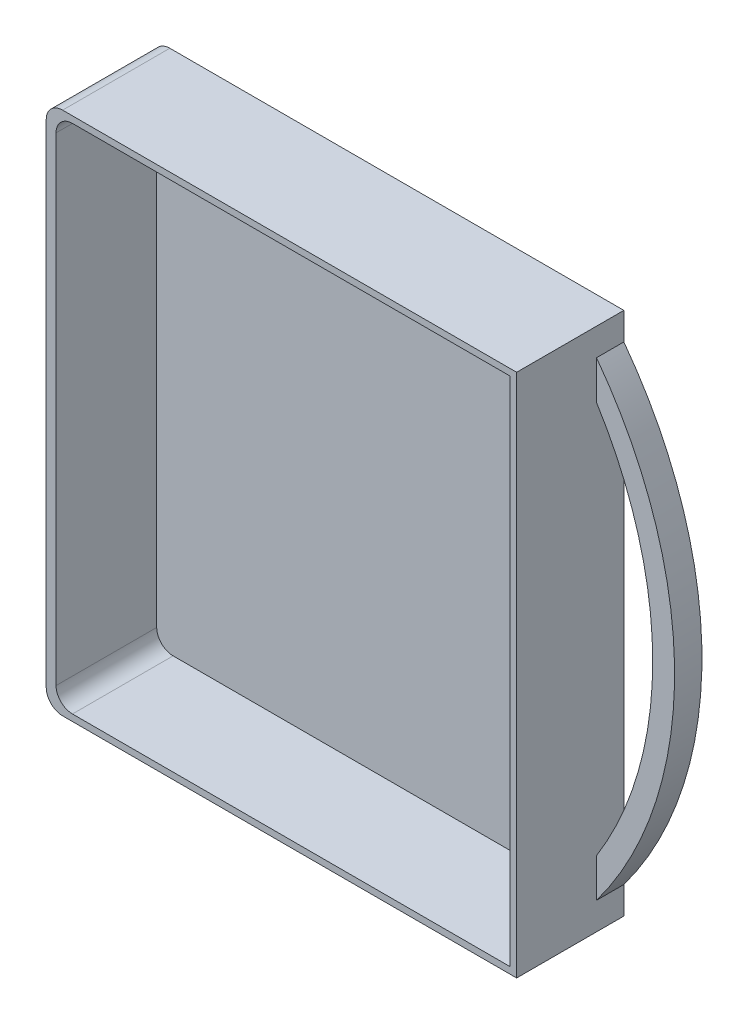
ISO-10303-21;
HEADER;
FILE_DESCRIPTION(('STEP AP214'),'2;1');
FILE_NAME('part.step','',(''),(''),'','','');
FILE_SCHEMA(('AUTOMOTIVE_DESIGN { 1 0 10303 214 1 1 1 1 }'));
ENDSEC;
DATA;
#1=APPLICATION_CONTEXT('core data for automotive mechanical design processes');
#2=APPLICATION_PROTOCOL_DEFINITION('international standard','automotive_design',2000,#1);
#3=PRODUCT_CONTEXT('',#1,'mechanical');
#4=PRODUCT('Part','Part','',(#3));
#5=PRODUCT_RELATED_PRODUCT_CATEGORY('part','',(#4));
#6=PRODUCT_DEFINITION_FORMATION('','',#4);
#7=PRODUCT_DEFINITION_CONTEXT('part definition',#1,'design');
#8=PRODUCT_DEFINITION('design','',#6,#7);
#9=PRODUCT_DEFINITION_SHAPE('','',#8);
#10=(LENGTH_UNIT() NAMED_UNIT(*) SI_UNIT(.MILLI.,.METRE.));
#11=(NAMED_UNIT(*) PLANE_ANGLE_UNIT() SI_UNIT($,.RADIAN.));
#12=(NAMED_UNIT(*) SI_UNIT($,.STERADIAN.) SOLID_ANGLE_UNIT());
#13=UNCERTAINTY_MEASURE_WITH_UNIT(LENGTH_MEASURE(1.E-05),#10,'distance_accuracy_value','');
#14=(GEOMETRIC_REPRESENTATION_CONTEXT(3) GLOBAL_UNCERTAINTY_ASSIGNED_CONTEXT((#13)) GLOBAL_UNIT_ASSIGNED_CONTEXT((#10,
#11,#12)) REPRESENTATION_CONTEXT('',''));
#15=CARTESIAN_POINT('',(0.,0.,0.));
#16=DIRECTION('',(0.,0.,1.));
#17=DIRECTION('',(1.,0.,0.));
#18=AXIS2_PLACEMENT_3D('',#15,#16,#17);
#19=CARTESIAN_POINT('',(43.,47.95,19.6));
#20=DIRECTION('',(-1.,0.,0.));
#21=DIRECTION('',(0.,-1.,0.));
#22=AXIS2_PLACEMENT_3D('',#19,#20,#21);
#23=PLANE('',#22);
#24=DIRECTION('',(0.,1.,0.));
#25=VECTOR('',#24,1.);
#26=CARTESIAN_POINT('',(43.,-42.95,5.));
#27=LINE('',#26,#25);
#28=CARTESIAN_POINT('',(43.,-42.95,5.));
#29=VERTEX_POINT('',#28);
#30=CARTESIAN_POINT('',(43.,-35.8706356230276,5.));
#31=VERTEX_POINT('',#30);
#32=EDGE_CURVE('E205',#29,#31,#27,.T.);
#33=ORIENTED_EDGE('',*,*,#32,.T.);
#34=DIRECTION('',(0.,0.,-1.));
#35=VECTOR('',#34,1.);
#36=CARTESIAN_POINT('',(43.,-35.8706356230276,5.));
#37=LINE('',#36,#35);
#38=CARTESIAN_POINT('',(43.,-35.8706356230276,0.));
#39=VERTEX_POINT('',#38);
#40=EDGE_CURVE('E212',#31,#39,#37,.T.);
#41=ORIENTED_EDGE('',*,*,#40,.T.);
#42=DIRECTION('',(0.,1.,0.));
#43=VECTOR('',#42,1.);
#44=CARTESIAN_POINT('',(43.,47.95,0.));
#45=LINE('',#44,#43);
#46=CARTESIAN_POINT('',(43.,35.8706356230276,0.));
#47=VERTEX_POINT('',#46);
#48=EDGE_CURVE('E238',#39,#47,#45,.T.);
#49=ORIENTED_EDGE('',*,*,#48,.T.);
#50=DIRECTION('',(0.,0.,-1.));
#51=VECTOR('',#50,1.);
#52=CARTESIAN_POINT('',(43.,35.8706356230276,5.));
#53=LINE('',#52,#51);
#54=CARTESIAN_POINT('',(43.,35.8706356230276,5.));
#55=VERTEX_POINT('',#54);
#56=EDGE_CURVE('E207',#55,#47,#53,.T.);
#57=ORIENTED_EDGE('',*,*,#56,.F.);
#58=DIRECTION('',(0.,1.,0.));
#59=VECTOR('',#58,1.);
#60=CARTESIAN_POINT('',(43.,35.8706356230276,5.));
#61=LINE('',#60,#59);
#62=CARTESIAN_POINT('',(43.,42.95,5.));
#63=VERTEX_POINT('',#62);
#64=EDGE_CURVE('E199',#55,#63,#61,.T.);
#65=ORIENTED_EDGE('',*,*,#64,.T.);
#66=DIRECTION('',(0.,0.,-1.));
#67=VECTOR('',#66,1.);
#68=CARTESIAN_POINT('',(43.,42.95,5.));
#69=LINE('',#68,#67);
#70=CARTESIAN_POINT('',(43.,42.95,0.));
#71=VERTEX_POINT('',#70);
#72=EDGE_CURVE('E219',#63,#71,#69,.T.);
#73=ORIENTED_EDGE('',*,*,#72,.T.);
#74=CARTESIAN_POINT('',(43.,47.95,0.));
#75=VERTEX_POINT('',#74);
#76=EDGE_CURVE('E215',#71,#75,#45,.T.);
#77=ORIENTED_EDGE('',*,*,#76,.T.);
#78=DIRECTION('',(0.,0.,-1.));
#79=VECTOR('',#78,1.);
#80=CARTESIAN_POINT('',(43.,47.95,19.6));
#81=LINE('',#80,#79);
#82=CARTESIAN_POINT('',(43.,47.95,19.6));
#83=VERTEX_POINT('',#82);
#84=EDGE_CURVE('E245',#83,#75,#81,.T.);
#85=ORIENTED_EDGE('',*,*,#84,.F.);
#86=DIRECTION('',(0.,1.,0.));
#87=VECTOR('',#86,1.);
#88=CARTESIAN_POINT('',(43.,47.95,19.6));
#89=LINE('',#88,#87);
#90=CARTESIAN_POINT('',(43.,-47.95,19.6));
#91=VERTEX_POINT('',#90);
#92=EDGE_CURVE('E224',#91,#83,#89,.T.);
#93=ORIENTED_EDGE('',*,*,#92,.F.);
#94=DIRECTION('',(0.,0.,-1.));
#95=VECTOR('',#94,1.);
#96=CARTESIAN_POINT('',(43.,-47.95,19.6));
#97=LINE('',#96,#95);
#98=CARTESIAN_POINT('',(43.,-47.95,0.));
#99=VERTEX_POINT('',#98);
#100=EDGE_CURVE('E234',#91,#99,#97,.T.);
#101=ORIENTED_EDGE('',*,*,#100,.T.);
#102=CARTESIAN_POINT('',(43.,-42.95,0.));
#103=VERTEX_POINT('',#102);
#104=EDGE_CURVE('E235',#99,#103,#45,.T.);
#105=ORIENTED_EDGE('',*,*,#104,.T.);
#106=DIRECTION('',(0.,0.,-1.));
#107=VECTOR('',#106,1.);
#108=CARTESIAN_POINT('',(43.,-42.95,5.));
#109=LINE('',#108,#107);
#110=EDGE_CURVE('E216',#29,#103,#109,.T.);
#111=ORIENTED_EDGE('',*,*,#110,.F.);
#112=EDGE_LOOP('',(#33,#41,#49,#57,#65,#73,#77,#85,#93,#101,#105,#111));
#113=FACE_BOUND('',#112,.T.);
#114=ADVANCED_FACE('F39',(#113),#23,.F.);
#115=CARTESIAN_POINT('',(-43.,47.95,19.6));
#116=DIRECTION('',(0.,-1.,0.));
#117=DIRECTION('',(0.,0.,-1.));
#118=AXIS2_PLACEMENT_3D('',#115,#116,#117);
#119=PLANE('',#118);
#120=DIRECTION('',(-1.,0.,0.));
#121=VECTOR('',#120,1.);
#122=CARTESIAN_POINT('',(-43.,47.95,0.));
#123=LINE('',#122,#121);
#124=CARTESIAN_POINT('',(-40.,47.95,0.));
#125=VERTEX_POINT('',#124);
#126=EDGE_CURVE('E237',#75,#125,#123,.T.);
#127=ORIENTED_EDGE('',*,*,#126,.T.);
#128=DIRECTION('',(0.,0.,-1.));
#129=VECTOR('',#128,1.);
#130=CARTESIAN_POINT('',(-40.,47.95,19.6));
#131=LINE('',#130,#129);
#132=CARTESIAN_POINT('',(-40.,47.95,19.6));
#133=VERTEX_POINT('',#132);
#134=EDGE_CURVE('E54',#125,#133,#131,.F.);
#135=ORIENTED_EDGE('',*,*,#134,.T.);
#136=DIRECTION('',(-1.,0.,0.));
#137=VECTOR('',#136,1.);
#138=CARTESIAN_POINT('',(-43.,47.95,19.6));
#139=LINE('',#138,#137);
#140=EDGE_CURVE('E227',#83,#133,#139,.T.);
#141=ORIENTED_EDGE('',*,*,#140,.F.);
#142=ORIENTED_EDGE('',*,*,#84,.T.);
#143=EDGE_LOOP('',(#127,#135,#141,#142));
#144=FACE_BOUND('',#143,.T.);
#145=ADVANCED_FACE('F303',(#144),#119,.F.);
#146=CARTESIAN_POINT('',(-43.,47.95,19.6));
#147=DIRECTION('',(1.,0.,0.));
#148=DIRECTION('',(0.,1.,0.));
#149=AXIS2_PLACEMENT_3D('',#146,#147,#148);
#150=PLANE('',#149);
#151=DIRECTION('',(0.,-1.,0.));
#152=VECTOR('',#151,1.);
#153=CARTESIAN_POINT('',(-43.,47.95,0.));
#154=LINE('',#153,#152);
#155=CARTESIAN_POINT('',(-43.,44.95,0.));
#156=VERTEX_POINT('',#155);
#157=CARTESIAN_POINT('',(-43.,-44.95,0.));
#158=VERTEX_POINT('',#157);
#159=EDGE_CURVE('E240',#156,#158,#154,.T.);
#160=ORIENTED_EDGE('',*,*,#159,.T.);
#161=DIRECTION('',(0.,0.,-1.));
#162=VECTOR('',#161,1.);
#163=CARTESIAN_POINT('',(-43.,-44.95,19.6));
#164=LINE('',#163,#162);
#165=CARTESIAN_POINT('',(-43.,-44.95,19.6));
#166=VERTEX_POINT('',#165);
#167=EDGE_CURVE('E62',#158,#166,#164,.F.);
#168=ORIENTED_EDGE('',*,*,#167,.T.);
#169=DIRECTION('',(0.,-1.,0.));
#170=VECTOR('',#169,1.);
#171=CARTESIAN_POINT('',(-43.,47.95,19.6));
#172=LINE('',#171,#170);
#173=CARTESIAN_POINT('',(-43.,44.95,19.6));
#174=VERTEX_POINT('',#173);
#175=EDGE_CURVE('E230',#174,#166,#172,.T.);
#176=ORIENTED_EDGE('',*,*,#175,.F.);
#177=DIRECTION('',(0.,0.,-1.));
#178=VECTOR('',#177,1.);
#179=CARTESIAN_POINT('',(-43.,44.95,19.6));
#180=LINE('',#179,#178);
#181=EDGE_CURVE('E267',#174,#156,#180,.T.);
#182=ORIENTED_EDGE('',*,*,#181,.T.);
#183=EDGE_LOOP('',(#160,#168,#176,#182));
#184=FACE_BOUND('',#183,.T.);
#185=ADVANCED_FACE('F309',(#184),#150,.F.);
#186=CARTESIAN_POINT('',(-43.,-47.95,19.6));
#187=DIRECTION('',(0.,1.,0.));
#188=DIRECTION('',(0.,0.,1.));
#189=AXIS2_PLACEMENT_3D('',#186,#187,#188);
#190=PLANE('',#189);
#191=DIRECTION('',(1.,0.,0.));
#192=VECTOR('',#191,1.);
#193=CARTESIAN_POINT('',(-43.,-47.95,19.6));
#194=LINE('',#193,#192);
#195=CARTESIAN_POINT('',(-40.,-47.95,19.6));
#196=VERTEX_POINT('',#195);
#197=EDGE_CURVE('E232',#196,#91,#194,.T.);
#198=ORIENTED_EDGE('',*,*,#197,.F.);
#199=DIRECTION('',(0.,0.,-1.));
#200=VECTOR('',#199,1.);
#201=CARTESIAN_POINT('',(-40.,-47.95,19.6));
#202=LINE('',#201,#200);
#203=CARTESIAN_POINT('',(-40.,-47.95,0.));
#204=VERTEX_POINT('',#203);
#205=EDGE_CURVE('E260',#196,#204,#202,.T.);
#206=ORIENTED_EDGE('',*,*,#205,.T.);
#207=DIRECTION('',(1.,0.,0.));
#208=VECTOR('',#207,1.);
#209=CARTESIAN_POINT('',(-43.,-47.95,0.));
#210=LINE('',#209,#208);
#211=EDGE_CURVE('E228',#204,#99,#210,.T.);
#212=ORIENTED_EDGE('',*,*,#211,.T.);
#213=ORIENTED_EDGE('',*,*,#100,.F.);
#214=EDGE_LOOP('',(#198,#206,#212,#213));
#215=FACE_BOUND('',#214,.T.);
#216=ADVANCED_FACE('F314',(#215),#190,.F.);
#217=CARTESIAN_POINT('',(0.,0.,19.6));
#218=DIRECTION('',(0.,0.,1.));
#219=DIRECTION('',(1.,0.,0.));
#220=AXIS2_PLACEMENT_3D('',#217,#218,#219);
#221=PLANE('',#220);
#222=DIRECTION('',(0.,-1.,0.));
#223=VECTOR('',#222,1.);
#224=CARTESIAN_POINT('',(-41.2,46.75,19.6));
#225=LINE('',#224,#223);
#226=CARTESIAN_POINT('',(-41.2,43.75,19.6));
#227=VERTEX_POINT('',#226);
#228=CARTESIAN_POINT('',(-41.2,-43.75,19.6));
#229=VERTEX_POINT('',#228);
#230=EDGE_CURVE('E185',#227,#229,#225,.T.);
#231=ORIENTED_EDGE('',*,*,#230,.F.);
#232=CARTESIAN_POINT('',(-38.2,43.75,19.6));
#233=DIRECTION('',(0.,0.,1.));
#234=DIRECTION('',(1.,0.,0.));
#235=AXIS2_PLACEMENT_3D('',#232,#233,#234);
#236=CIRCLE('',#235,3.);
#237=CARTESIAN_POINT('',(-38.2,46.75,19.6));
#238=VERTEX_POINT('',#237);
#239=EDGE_CURVE('E47',#227,#238,#236,.F.);
#240=ORIENTED_EDGE('',*,*,#239,.T.);
#241=DIRECTION('',(-1.,0.,0.));
#242=VECTOR('',#241,1.);
#243=CARTESIAN_POINT('',(41.8,46.75,19.6));
#244=LINE('',#243,#242);
#245=CARTESIAN_POINT('',(41.8,46.75,19.6));
#246=VERTEX_POINT('',#245);
#247=EDGE_CURVE('E191',#246,#238,#244,.T.);
#248=ORIENTED_EDGE('',*,*,#247,.F.);
#249=DIRECTION('',(0.,1.,0.));
#250=VECTOR('',#249,1.);
#251=CARTESIAN_POINT('',(41.8,-46.75,19.6));
#252=LINE('',#251,#250);
#253=CARTESIAN_POINT('',(41.8,-46.75,19.6));
#254=VERTEX_POINT('',#253);
#255=EDGE_CURVE('E189',#254,#246,#252,.T.);
#256=ORIENTED_EDGE('',*,*,#255,.F.);
#257=DIRECTION('',(1.,0.,0.));
#258=VECTOR('',#257,1.);
#259=CARTESIAN_POINT('',(-41.2,-46.75,19.6));
#260=LINE('',#259,#258);
#261=CARTESIAN_POINT('',(-38.2,-46.75,19.6));
#262=VERTEX_POINT('',#261);
#263=EDGE_CURVE('E173',#262,#254,#260,.T.);
#264=ORIENTED_EDGE('',*,*,#263,.F.);
#265=CARTESIAN_POINT('',(-38.2,-43.75,19.6));
#266=DIRECTION('',(0.,0.,1.));
#267=DIRECTION('',(1.,0.,0.));
#268=AXIS2_PLACEMENT_3D('',#265,#266,#267);
#269=CIRCLE('',#268,3.);
#270=EDGE_CURVE('E11',#262,#229,#269,.F.);
#271=ORIENTED_EDGE('',*,*,#270,.T.);
#272=EDGE_LOOP('',(#231,#240,#248,#256,#264,#271));
#273=FACE_BOUND('',#272,.T.);
#274=ORIENTED_EDGE('',*,*,#175,.T.);
#275=CARTESIAN_POINT('',(-40.,-44.95,19.6));
#276=DIRECTION('',(0.,0.,1.));
#277=DIRECTION('',(1.,0.,0.));
#278=AXIS2_PLACEMENT_3D('',#275,#276,#277);
#279=CIRCLE('',#278,3.);
#280=EDGE_CURVE('E273',#166,#196,#279,.T.);
#281=ORIENTED_EDGE('',*,*,#280,.T.);
#282=ORIENTED_EDGE('',*,*,#197,.T.);
#283=ORIENTED_EDGE('',*,*,#92,.T.);
#284=ORIENTED_EDGE('',*,*,#140,.T.);
#285=CARTESIAN_POINT('',(-40.,44.95,19.6));
#286=DIRECTION('',(0.,0.,1.));
#287=DIRECTION('',(1.,0.,0.));
#288=AXIS2_PLACEMENT_3D('',#285,#286,#287);
#289=CIRCLE('',#288,3.);
#290=EDGE_CURVE('E271',#133,#174,#289,.T.);
#291=ORIENTED_EDGE('',*,*,#290,.T.);
#292=EDGE_LOOP('',(#274,#281,#282,#283,#284,#291));
#293=FACE_BOUND('',#292,.T.);
#294=ADVANCED_FACE('F278',(#273,#293),#221,.T.);
#295=CARTESIAN_POINT('',(0.,0.,0.));
#296=DIRECTION('',(0.,0.,1.));
#297=DIRECTION('',(1.,0.,0.));
#298=AXIS2_PLACEMENT_3D('',#295,#296,#297);
#299=PLANE('',#298);
#300=ORIENTED_EDGE('',*,*,#48,.F.);
#301=CARTESIAN_POINT('',(-14.4748640711745,0.,0.));
#302=DIRECTION('',(0.,0.,1.));
#303=DIRECTION('',(1.,0.,0.));
#304=AXIS2_PLACEMENT_3D('',#301,#302,#303);
#305=CIRCLE('',#304,67.75);
#306=EDGE_CURVE('E194',#39,#47,#305,.T.);
#307=ORIENTED_EDGE('',*,*,#306,.T.);
#308=EDGE_LOOP('',(#300,#307));
#309=FACE_BOUND('',#308,.T.);
#310=ORIENTED_EDGE('',*,*,#211,.F.);
#311=CARTESIAN_POINT('',(-40.,-44.95,0.));
#312=DIRECTION('',(0.,0.,1.));
#313=DIRECTION('',(1.,0.,0.));
#314=AXIS2_PLACEMENT_3D('',#311,#312,#313);
#315=CIRCLE('',#314,3.);
#316=EDGE_CURVE('E265',#204,#158,#315,.F.);
#317=ORIENTED_EDGE('',*,*,#316,.T.);
#318=ORIENTED_EDGE('',*,*,#159,.F.);
#319=CARTESIAN_POINT('',(-40.,44.95,0.));
#320=DIRECTION('',(0.,0.,1.));
#321=DIRECTION('',(1.,0.,0.));
#322=AXIS2_PLACEMENT_3D('',#319,#320,#321);
#323=CIRCLE('',#322,3.);
#324=EDGE_CURVE('E263',#156,#125,#323,.F.);
#325=ORIENTED_EDGE('',*,*,#324,.T.);
#326=ORIENTED_EDGE('',*,*,#126,.F.);
#327=ORIENTED_EDGE('',*,*,#76,.F.);
#328=CARTESIAN_POINT('',(-14.4748640711745,0.,0.));
#329=DIRECTION('',(0.,0.,-1.));
#330=DIRECTION('',(-1.,0.,0.));
#331=AXIS2_PLACEMENT_3D('',#328,#329,#330);
#332=CIRCLE('',#331,71.7499999999999);
#333=EDGE_CURVE('E200',#71,#103,#332,.T.);
#334=ORIENTED_EDGE('',*,*,#333,.T.);
#335=ORIENTED_EDGE('',*,*,#104,.F.);
#336=EDGE_LOOP('',(#310,#317,#318,#325,#326,#327,#334,#335));
#337=FACE_BOUND('',#336,.T.);
#338=ADVANCED_FACE('F318',(#309,#337),#299,.F.);
#339=CARTESIAN_POINT('',(-14.4748640711745,0.,5.));
#340=DIRECTION('',(0.,0.,-1.));
#341=DIRECTION('',(-1.,0.,0.));
#342=AXIS2_PLACEMENT_3D('',#339,#340,#341);
#343=CYLINDRICAL_SURFACE('',#342,67.75);
#344=ORIENTED_EDGE('',*,*,#306,.F.);
#345=ORIENTED_EDGE('',*,*,#40,.F.);
#346=CARTESIAN_POINT('',(-14.4748640711745,0.,5.));
#347=DIRECTION('',(0.,0.,1.));
#348=DIRECTION('',(1.,0.,0.));
#349=AXIS2_PLACEMENT_3D('',#346,#347,#348);
#350=CIRCLE('',#349,67.75);
#351=EDGE_CURVE('E196',#31,#55,#350,.T.);
#352=ORIENTED_EDGE('',*,*,#351,.T.);
#353=ORIENTED_EDGE('',*,*,#56,.T.);
#354=EDGE_LOOP('',(#344,#345,#352,#353));
#355=FACE_BOUND('',#354,.T.);
#356=ADVANCED_FACE('F321',(#355),#343,.F.);
#357=CARTESIAN_POINT('',(-14.4748640711745,0.,5.));
#358=DIRECTION('',(0.,0.,-1.));
#359=DIRECTION('',(-1.,0.,0.));
#360=AXIS2_PLACEMENT_3D('',#357,#358,#359);
#361=CYLINDRICAL_SURFACE('',#360,71.7499999999999);
#362=ORIENTED_EDGE('',*,*,#333,.F.);
#363=ORIENTED_EDGE('',*,*,#72,.F.);
#364=CARTESIAN_POINT('',(-14.4748640711745,0.,5.));
#365=DIRECTION('',(0.,0.,-1.));
#366=DIRECTION('',(-1.,0.,0.));
#367=AXIS2_PLACEMENT_3D('',#364,#365,#366);
#368=CIRCLE('',#367,71.7499999999999);
#369=EDGE_CURVE('E202',#63,#29,#368,.T.);
#370=ORIENTED_EDGE('',*,*,#369,.T.);
#371=ORIENTED_EDGE('',*,*,#110,.T.);
#372=EDGE_LOOP('',(#362,#363,#370,#371));
#373=FACE_BOUND('',#372,.T.);
#374=ADVANCED_FACE('F327',(#373),#361,.T.);
#375=CARTESIAN_POINT('',(-14.4748640711745,0.,5.));
#376=DIRECTION('',(0.,0.,1.));
#377=DIRECTION('',(1.,0.,0.));
#378=AXIS2_PLACEMENT_3D('',#375,#376,#377);
#379=PLANE('',#378);
#380=ORIENTED_EDGE('',*,*,#351,.F.);
#381=ORIENTED_EDGE('',*,*,#32,.F.);
#382=ORIENTED_EDGE('',*,*,#369,.F.);
#383=ORIENTED_EDGE('',*,*,#64,.F.);
#384=EDGE_LOOP('',(#380,#381,#382,#383));
#385=FACE_BOUND('',#384,.T.);
#386=ADVANCED_FACE('F331',(#385),#379,.T.);
#387=CARTESIAN_POINT('',(-41.2,46.75,1.2));
#388=DIRECTION('',(-1.,0.,0.));
#389=DIRECTION('',(0.,-1.,0.));
#390=AXIS2_PLACEMENT_3D('',#387,#388,#389);
#391=PLANE('',#390);
#392=DIRECTION('',(0.,-1.,0.));
#393=VECTOR('',#392,1.);
#394=CARTESIAN_POINT('',(-41.2,46.75,1.2));
#395=LINE('',#394,#393);
#396=CARTESIAN_POINT('',(-41.2,43.75,1.2));
#397=VERTEX_POINT('',#396);
#398=CARTESIAN_POINT('',(-41.2,-43.75,1.2));
#399=VERTEX_POINT('',#398);
#400=EDGE_CURVE('E167',#397,#399,#395,.T.);
#401=ORIENTED_EDGE('',*,*,#400,.F.);
#402=DIRECTION('',(0.,0.,1.));
#403=VECTOR('',#402,1.);
#404=CARTESIAN_POINT('',(-41.2,43.75,19.6));
#405=LINE('',#404,#403);
#406=EDGE_CURVE('E250',#397,#227,#405,.T.);
#407=ORIENTED_EDGE('',*,*,#406,.T.);
#408=ORIENTED_EDGE('',*,*,#230,.T.);
#409=DIRECTION('',(0.,0.,1.));
#410=VECTOR('',#409,1.);
#411=CARTESIAN_POINT('',(-41.2,-43.75,1.2));
#412=LINE('',#411,#410);
#413=EDGE_CURVE('E248',#229,#399,#412,.F.);
#414=ORIENTED_EDGE('',*,*,#413,.T.);
#415=EDGE_LOOP('',(#401,#407,#408,#414));
#416=FACE_BOUND('',#415,.T.);
#417=ADVANCED_FACE('F289',(#416),#391,.F.);
#418=CARTESIAN_POINT('',(41.8,46.75,1.2));
#419=DIRECTION('',(0.,1.,0.));
#420=DIRECTION('',(-1.,0.,0.));
#421=AXIS2_PLACEMENT_3D('',#418,#419,#420);
#422=PLANE('',#421);
#423=ORIENTED_EDGE('',*,*,#247,.T.);
#424=DIRECTION('',(0.,0.,1.));
#425=VECTOR('',#424,1.);
#426=CARTESIAN_POINT('',(-38.2,46.75,1.2));
#427=LINE('',#426,#425);
#428=CARTESIAN_POINT('',(-38.2,46.75,1.2));
#429=VERTEX_POINT('',#428);
#430=EDGE_CURVE('E253',#238,#429,#427,.F.);
#431=ORIENTED_EDGE('',*,*,#430,.T.);
#432=DIRECTION('',(-1.,0.,0.));
#433=VECTOR('',#432,1.);
#434=CARTESIAN_POINT('',(41.8,46.75,1.2));
#435=LINE('',#434,#433);
#436=CARTESIAN_POINT('',(41.8,46.75,1.2));
#437=VERTEX_POINT('',#436);
#438=EDGE_CURVE('E178',#437,#429,#435,.T.);
#439=ORIENTED_EDGE('',*,*,#438,.F.);
#440=DIRECTION('',(0.,0.,1.));
#441=VECTOR('',#440,1.);
#442=CARTESIAN_POINT('',(41.8,46.75,1.2));
#443=LINE('',#442,#441);
#444=EDGE_CURVE('E177',#437,#246,#443,.T.);
#445=ORIENTED_EDGE('',*,*,#444,.T.);
#446=EDGE_LOOP('',(#423,#431,#439,#445));
#447=FACE_BOUND('',#446,.T.);
#448=ADVANCED_FACE('F284',(#447),#422,.F.);
#449=CARTESIAN_POINT('',(41.8,-46.75,1.2));
#450=DIRECTION('',(1.,0.,0.));
#451=DIRECTION('',(0.,1.,0.));
#452=AXIS2_PLACEMENT_3D('',#449,#450,#451);
#453=PLANE('',#452);
#454=ORIENTED_EDGE('',*,*,#255,.T.);
#455=ORIENTED_EDGE('',*,*,#444,.F.);
#456=DIRECTION('',(0.,1.,0.));
#457=VECTOR('',#456,1.);
#458=CARTESIAN_POINT('',(41.8,-46.75,1.2));
#459=LINE('',#458,#457);
#460=CARTESIAN_POINT('',(41.8,-46.75,1.2));
#461=VERTEX_POINT('',#460);
#462=EDGE_CURVE('E159',#461,#437,#459,.T.);
#463=ORIENTED_EDGE('',*,*,#462,.F.);
#464=DIRECTION('',(0.,0.,1.));
#465=VECTOR('',#464,1.);
#466=CARTESIAN_POINT('',(41.8,-46.75,1.2));
#467=LINE('',#466,#465);
#468=EDGE_CURVE('E170',#461,#254,#467,.T.);
#469=ORIENTED_EDGE('',*,*,#468,.T.);
#470=EDGE_LOOP('',(#454,#455,#463,#469));
#471=FACE_BOUND('',#470,.T.);
#472=ADVANCED_FACE('F180',(#471),#453,.F.);
#473=CARTESIAN_POINT('',(-41.2,-46.75,1.2));
#474=DIRECTION('',(0.,-1.,0.));
#475=DIRECTION('',(0.,0.,-1.));
#476=AXIS2_PLACEMENT_3D('',#473,#474,#475);
#477=PLANE('',#476);
#478=DIRECTION('',(1.,0.,0.));
#479=VECTOR('',#478,1.);
#480=CARTESIAN_POINT('',(-41.2,-46.75,1.2));
#481=LINE('',#480,#479);
#482=CARTESIAN_POINT('',(-38.2,-46.75,1.2));
#483=VERTEX_POINT('',#482);
#484=EDGE_CURVE('E154',#483,#461,#481,.T.);
#485=ORIENTED_EDGE('',*,*,#484,.F.);
#486=DIRECTION('',(0.,0.,1.));
#487=VECTOR('',#486,1.);
#488=CARTESIAN_POINT('',(-38.2,-46.75,19.6));
#489=LINE('',#488,#487);
#490=EDGE_CURVE('E258',#483,#262,#489,.T.);
#491=ORIENTED_EDGE('',*,*,#490,.T.);
#492=ORIENTED_EDGE('',*,*,#263,.T.);
#493=ORIENTED_EDGE('',*,*,#468,.F.);
#494=EDGE_LOOP('',(#485,#491,#492,#493));
#495=FACE_BOUND('',#494,.T.);
#496=ADVANCED_FACE('F171',(#495),#477,.F.);
#497=CARTESIAN_POINT('',(0.,0.,1.2));
#498=DIRECTION('',(0.,0.,1.));
#499=DIRECTION('',(1.,0.,0.));
#500=AXIS2_PLACEMENT_3D('',#497,#498,#499);
#501=PLANE('',#500);
#502=ORIENTED_EDGE('',*,*,#438,.T.);
#503=CARTESIAN_POINT('',(-38.2,43.75,1.2));
#504=DIRECTION('',(0.,0.,1.));
#505=DIRECTION('',(1.,0.,0.));
#506=AXIS2_PLACEMENT_3D('',#503,#504,#505);
#507=CIRCLE('',#506,3.);
#508=EDGE_CURVE('E256',#429,#397,#507,.T.);
#509=ORIENTED_EDGE('',*,*,#508,.T.);
#510=ORIENTED_EDGE('',*,*,#400,.T.);
#511=CARTESIAN_POINT('',(-38.2,-43.75,1.2));
#512=DIRECTION('',(0.,0.,1.));
#513=DIRECTION('',(1.,0.,0.));
#514=AXIS2_PLACEMENT_3D('',#511,#512,#513);
#515=CIRCLE('',#514,3.);
#516=EDGE_CURVE('E163',#399,#483,#515,.T.);
#517=ORIENTED_EDGE('',*,*,#516,.T.);
#518=ORIENTED_EDGE('',*,*,#484,.T.);
#519=ORIENTED_EDGE('',*,*,#462,.T.);
#520=EDGE_LOOP('',(#502,#509,#510,#517,#518,#519));
#521=FACE_BOUND('',#520,.T.);
#522=ADVANCED_FACE('F157',(#521),#501,.T.);
#523=CARTESIAN_POINT('',(-38.2,43.75,1.2));
#524=DIRECTION('',(0.,0.,-1.));
#525=DIRECTION('',(-1.,0.,0.));
#526=AXIS2_PLACEMENT_3D('',#523,#524,#525);
#527=CYLINDRICAL_SURFACE('',#526,3.);
#528=ORIENTED_EDGE('',*,*,#508,.F.);
#529=ORIENTED_EDGE('',*,*,#430,.F.);
#530=ORIENTED_EDGE('',*,*,#239,.F.);
#531=ORIENTED_EDGE('',*,*,#406,.F.);
#532=EDGE_LOOP('',(#528,#529,#530,#531));
#533=FACE_BOUND('',#532,.T.);
#534=ADVANCED_FACE('F286',(#533),#527,.F.);
#535=CARTESIAN_POINT('',(-38.2,-43.75,1.2));
#536=DIRECTION('',(0.,0.,-1.));
#537=DIRECTION('',(-1.,0.,0.));
#538=AXIS2_PLACEMENT_3D('',#535,#536,#537);
#539=CYLINDRICAL_SURFACE('',#538,3.);
#540=ORIENTED_EDGE('',*,*,#516,.F.);
#541=ORIENTED_EDGE('',*,*,#413,.F.);
#542=ORIENTED_EDGE('',*,*,#270,.F.);
#543=ORIENTED_EDGE('',*,*,#490,.F.);
#544=EDGE_LOOP('',(#540,#541,#542,#543));
#545=FACE_BOUND('',#544,.T.);
#546=ADVANCED_FACE('F292',(#545),#539,.F.);
#547=CARTESIAN_POINT('',(-40.,-44.95,19.6));
#548=DIRECTION('',(0.,0.,-1.));
#549=DIRECTION('',(-1.,0.,0.));
#550=AXIS2_PLACEMENT_3D('',#547,#548,#549);
#551=CYLINDRICAL_SURFACE('',#550,3.);
#552=ORIENTED_EDGE('',*,*,#280,.F.);
#553=ORIENTED_EDGE('',*,*,#167,.F.);
#554=ORIENTED_EDGE('',*,*,#316,.F.);
#555=ORIENTED_EDGE('',*,*,#205,.F.);
#556=EDGE_LOOP('',(#552,#553,#554,#555));
#557=FACE_BOUND('',#556,.T.);
#558=ADVANCED_FACE('F294',(#557),#551,.T.);
#559=CARTESIAN_POINT('',(-40.,44.95,19.6));
#560=DIRECTION('',(0.,0.,-1.));
#561=DIRECTION('',(-1.,0.,0.));
#562=AXIS2_PLACEMENT_3D('',#559,#560,#561);
#563=CYLINDRICAL_SURFACE('',#562,3.);
#564=ORIENTED_EDGE('',*,*,#290,.F.);
#565=ORIENTED_EDGE('',*,*,#134,.F.);
#566=ORIENTED_EDGE('',*,*,#324,.F.);
#567=ORIENTED_EDGE('',*,*,#181,.F.);
#568=EDGE_LOOP('',(#564,#565,#566,#567));
#569=FACE_BOUND('',#568,.T.);
#570=ADVANCED_FACE('F41',(#569),#563,.T.);
#571=CLOSED_SHELL('',(#114,#145,#185,#216,#294,#338,#356,#374,#386,#417,#448,#472,#496,#522,
#534,#546,#558,#570));
#572=MANIFOLD_SOLID_BREP('B2',#571);
#573=ADVANCED_BREP_SHAPE_REPRESENTATION('',(#18,#572),#14);
#574=SHAPE_DEFINITION_REPRESENTATION(#9,#573);
ENDSEC;
END-ISO-10303-21;
